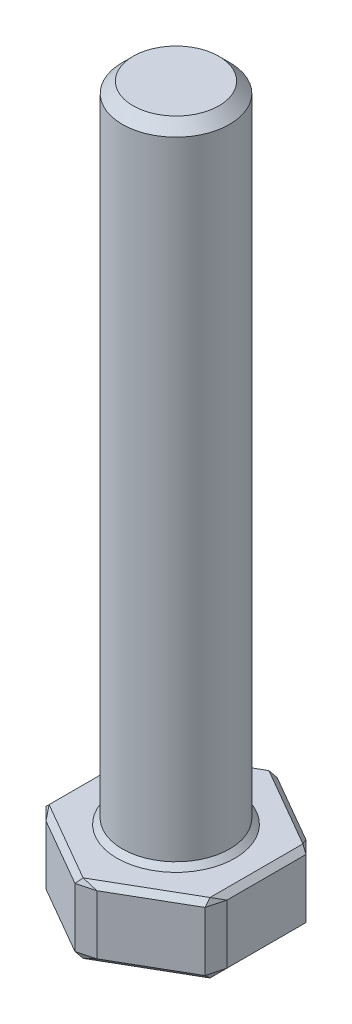
ISO-10303-21;
HEADER;
FILE_DESCRIPTION(('STEP AP214'),'2;1');
FILE_NAME('part.step','',(''),(''),'','','');
FILE_SCHEMA(('AUTOMOTIVE_DESIGN { 1 0 10303 214 1 1 1 1 }'));
ENDSEC;
DATA;
#1=APPLICATION_CONTEXT('core data for automotive mechanical design processes');
#2=APPLICATION_PROTOCOL_DEFINITION('international standard','automotive_design',2000,#1);
#3=PRODUCT_CONTEXT('',#1,'mechanical');
#4=PRODUCT('Part','Part','',(#3));
#5=PRODUCT_RELATED_PRODUCT_CATEGORY('part','',(#4));
#6=PRODUCT_DEFINITION_FORMATION('','',#4);
#7=PRODUCT_DEFINITION_CONTEXT('part definition',#1,'design');
#8=PRODUCT_DEFINITION('design','',#6,#7);
#9=PRODUCT_DEFINITION_SHAPE('','',#8);
#10=(LENGTH_UNIT() NAMED_UNIT(*) SI_UNIT(.MILLI.,.METRE.));
#11=(NAMED_UNIT(*) PLANE_ANGLE_UNIT() SI_UNIT($,.RADIAN.));
#12=(NAMED_UNIT(*) SI_UNIT($,.STERADIAN.) SOLID_ANGLE_UNIT());
#13=UNCERTAINTY_MEASURE_WITH_UNIT(LENGTH_MEASURE(1.E-05),#10,'distance_accuracy_value','');
#14=(GEOMETRIC_REPRESENTATION_CONTEXT(3) GLOBAL_UNCERTAINTY_ASSIGNED_CONTEXT((#13)) GLOBAL_UNIT_ASSIGNED_CONTEXT((#10,
#11,#12)) REPRESENTATION_CONTEXT('',''));
#15=CARTESIAN_POINT('',(0.,0.,0.));
#16=DIRECTION('',(0.,0.,1.));
#17=DIRECTION('',(1.,0.,0.));
#18=AXIS2_PLACEMENT_3D('',#15,#16,#17);
#19=CARTESIAN_POINT('',(-7.99999999999995,6.5,4.6188021535171));
#20=DIRECTION('',(0.499999999999995,0.,-0.866025403784442));
#21=DIRECTION('',(-0.866025403784442,0.,-0.499999999999995));
#22=AXIS2_PLACEMENT_3D('',#19,#20,#21);
#23=PLANE('',#22);
#24=DIRECTION('',(-0.866025403784442,0.,-0.499999999999995));
#25=VECTOR('',#24,1.);
#26=CARTESIAN_POINT('',(-7.99999999999995,6.00000000000001,4.6188021535171));
#27=LINE('',#26,#25);
#28=CARTESIAN_POINT('',(-0.433012701892224,6.00000000000001,8.98760430703402));
#29=VERTEX_POINT('',#28);
#30=CARTESIAN_POINT('',(-6.81698729810772,6.00000000000001,5.30181485540932));
#31=VERTEX_POINT('',#30);
#32=EDGE_CURVE('E254',#29,#31,#27,.T.);
#33=ORIENTED_EDGE('',*,*,#32,.T.);
#34=DIRECTION('',(0.,-1.,0.));
#35=VECTOR('',#34,1.);
#36=CARTESIAN_POINT('',(-6.81698729810772,6.5,5.30181485540932));
#37=LINE('',#36,#35);
#38=CARTESIAN_POINT('',(-6.81698729810772,0.499999999999994,5.30181485540932));
#39=VERTEX_POINT('',#38);
#40=EDGE_CURVE('E256',#31,#39,#37,.T.);
#41=ORIENTED_EDGE('',*,*,#40,.T.);
#42=DIRECTION('',(0.866025403784442,0.,0.499999999999995));
#43=VECTOR('',#42,1.);
#44=CARTESIAN_POINT('',(-7.99999999999995,0.499999999999994,4.6188021535171));
#45=LINE('',#44,#43);
#46=CARTESIAN_POINT('',(-0.433012701892224,0.499999999999994,8.98760430703402));
#47=VERTEX_POINT('',#46);
#48=EDGE_CURVE('E250',#39,#47,#45,.T.);
#49=ORIENTED_EDGE('',*,*,#48,.T.);
#50=DIRECTION('',(0.,1.,0.));
#51=VECTOR('',#50,1.);
#52=CARTESIAN_POINT('',(-0.433012701892223,6.5,8.98760430703402));
#53=LINE('',#52,#51);
#54=EDGE_CURVE('E252',#47,#29,#53,.T.);
#55=ORIENTED_EDGE('',*,*,#54,.T.);
#56=EDGE_LOOP('',(#33,#41,#49,#55));
#57=FACE_BOUND('',#56,.T.);
#58=ADVANCED_FACE('F33',(#57),#23,.F.);
#59=CARTESIAN_POINT('',(0.,6.5,9.23760430703402));
#60=DIRECTION('',(-0.500000000000001,0.,-0.866025403784438));
#61=DIRECTION('',(-0.866025403784438,0.,0.500000000000001));
#62=AXIS2_PLACEMENT_3D('',#59,#60,#61);
#63=PLANE('',#62);
#64=DIRECTION('',(0.866025403784438,0.,-0.500000000000001));
#65=VECTOR('',#64,1.);
#66=CARTESIAN_POINT('',(0.,0.499999999999994,9.23760430703402));
#67=LINE('',#66,#65);
#68=CARTESIAN_POINT('',(1.18301270189224,0.499999999999993,8.55459160514179));
#69=VERTEX_POINT('',#68);
#70=CARTESIAN_POINT('',(7.5669872981078,0.499999999999993,4.86880215351699));
#71=VERTEX_POINT('',#70);
#72=EDGE_CURVE('E241',#69,#71,#67,.T.);
#73=ORIENTED_EDGE('',*,*,#72,.T.);
#74=DIRECTION('',(0.,1.,0.));
#75=VECTOR('',#74,1.);
#76=CARTESIAN_POINT('',(7.5669872981078,6.5,4.86880215351699));
#77=LINE('',#76,#75);
#78=CARTESIAN_POINT('',(7.5669872981078,6.00000000000001,4.86880215351699));
#79=VERTEX_POINT('',#78);
#80=EDGE_CURVE('E247',#71,#79,#77,.T.);
#81=ORIENTED_EDGE('',*,*,#80,.T.);
#82=DIRECTION('',(-0.866025403784438,0.,0.500000000000001));
#83=VECTOR('',#82,1.);
#84=CARTESIAN_POINT('',(0.,6.00000000000001,9.23760430703402));
#85=LINE('',#84,#83);
#86=CARTESIAN_POINT('',(1.18301270189224,6.00000000000001,8.55459160514179));
#87=VERTEX_POINT('',#86);
#88=EDGE_CURVE('E245',#79,#87,#85,.T.);
#89=ORIENTED_EDGE('',*,*,#88,.T.);
#90=DIRECTION('',(0.,-1.,0.));
#91=VECTOR('',#90,1.);
#92=CARTESIAN_POINT('',(1.18301270189224,6.5,8.55459160514179));
#93=LINE('',#92,#91);
#94=EDGE_CURVE('E243',#87,#69,#93,.T.);
#95=ORIENTED_EDGE('',*,*,#94,.T.);
#96=EDGE_LOOP('',(#73,#81,#89,#95));
#97=FACE_BOUND('',#96,.T.);
#98=ADVANCED_FACE('F469',(#97),#63,.F.);
#99=CARTESIAN_POINT('',(8.00000000000002,6.5,4.61880215351699));
#100=DIRECTION('',(-1.,0.,0.));
#101=DIRECTION('',(0.,0.,1.));
#102=AXIS2_PLACEMENT_3D('',#99,#100,#101);
#103=PLANE('',#102);
#104=DIRECTION('',(0.,1.,0.));
#105=VECTOR('',#104,1.);
#106=CARTESIAN_POINT('',(7.99999999999998,6.5,-4.11880215351704));
#107=LINE('',#106,#105);
#108=CARTESIAN_POINT('',(7.99999999999998,0.499999999999994,-4.11880215351704));
#109=VERTEX_POINT('',#108);
#110=CARTESIAN_POINT('',(7.99999999999998,6.00000000000001,-4.11880215351704));
#111=VERTEX_POINT('',#110);
#112=EDGE_CURVE('E236',#109,#111,#107,.T.);
#113=ORIENTED_EDGE('',*,*,#112,.T.);
#114=DIRECTION('',(0.,0.,1.));
#115=VECTOR('',#114,1.);
#116=CARTESIAN_POINT('',(8.00000000000002,6.00000000000001,4.61880215351699));
#117=LINE('',#116,#115);
#118=CARTESIAN_POINT('',(8.00000000000001,6.00000000000001,3.25277674973256));
#119=VERTEX_POINT('',#118);
#120=EDGE_CURVE('E239',#111,#119,#117,.T.);
#121=ORIENTED_EDGE('',*,*,#120,.T.);
#122=DIRECTION('',(0.,-1.,0.));
#123=VECTOR('',#122,1.);
#124=CARTESIAN_POINT('',(8.00000000000001,6.5,3.25277674973256));
#125=LINE('',#124,#123);
#126=CARTESIAN_POINT('',(8.00000000000001,0.499999999999994,3.25277674973256));
#127=VERTEX_POINT('',#126);
#128=EDGE_CURVE('E234',#119,#127,#125,.T.);
#129=ORIENTED_EDGE('',*,*,#128,.T.);
#130=DIRECTION('',(0.,0.,-1.));
#131=VECTOR('',#130,1.);
#132=CARTESIAN_POINT('',(8.00000000000002,0.499999999999994,4.61880215351699));
#133=LINE('',#132,#131);
#134=EDGE_CURVE('E232',#127,#109,#133,.T.);
#135=ORIENTED_EDGE('',*,*,#134,.T.);
#136=EDGE_LOOP('',(#113,#121,#129,#135));
#137=FACE_BOUND('',#136,.T.);
#138=ADVANCED_FACE('F473',(#137),#103,.F.);
#139=CARTESIAN_POINT('',(7.99999999999998,6.5,-4.61880215351705));
#140=DIRECTION('',(-0.499999999999995,0.,0.866025403784441));
#141=DIRECTION('',(0.866025403784441,0.,0.499999999999995));
#142=AXIS2_PLACEMENT_3D('',#139,#140,#141);
#143=PLANE('',#142);
#144=DIRECTION('',(0.,1.,0.));
#145=VECTOR('',#144,1.);
#146=CARTESIAN_POINT('',(0.433012701892162,6.5,-8.98760430703402));
#147=LINE('',#146,#145);
#148=CARTESIAN_POINT('',(0.433012701892161,0.499999999999994,-8.98760430703402));
#149=VERTEX_POINT('',#148);
#150=CARTESIAN_POINT('',(0.433012701892161,6.00000000000001,-8.98760430703402));
#151=VERTEX_POINT('',#150);
#152=EDGE_CURVE('E227',#149,#151,#147,.T.);
#153=ORIENTED_EDGE('',*,*,#152,.T.);
#154=DIRECTION('',(0.866025403784441,0.,0.499999999999995));
#155=VECTOR('',#154,1.);
#156=CARTESIAN_POINT('',(7.99999999999998,6.00000000000001,-4.61880215351705));
#157=LINE('',#156,#155);
#158=CARTESIAN_POINT('',(6.81698729810778,6.00000000000001,-5.30181485540925));
#159=VERTEX_POINT('',#158);
#160=EDGE_CURVE('E230',#151,#159,#157,.T.);
#161=ORIENTED_EDGE('',*,*,#160,.T.);
#162=DIRECTION('',(0.,-1.,0.));
#163=VECTOR('',#162,1.);
#164=CARTESIAN_POINT('',(6.81698729810778,6.5,-5.30181485540925));
#165=LINE('',#164,#163);
#166=CARTESIAN_POINT('',(6.81698729810778,0.499999999999994,-5.30181485540925));
#167=VERTEX_POINT('',#166);
#168=EDGE_CURVE('E225',#159,#167,#165,.T.);
#169=ORIENTED_EDGE('',*,*,#168,.T.);
#170=DIRECTION('',(-0.866025403784441,0.,-0.499999999999995));
#171=VECTOR('',#170,1.);
#172=CARTESIAN_POINT('',(7.99999999999998,0.499999999999994,-4.61880215351705));
#173=LINE('',#172,#171);
#174=EDGE_CURVE('E223',#167,#149,#173,.T.);
#175=ORIENTED_EDGE('',*,*,#174,.T.);
#176=EDGE_LOOP('',(#153,#161,#169,#175));
#177=FACE_BOUND('',#176,.T.);
#178=ADVANCED_FACE('F430',(#177),#143,.F.);
#179=CARTESIAN_POINT('',(0.,6.5,-9.23760430703402));
#180=DIRECTION('',(0.500000000000007,0.,0.866025403784434));
#181=DIRECTION('',(0.866025403784435,0.,-0.500000000000007));
#182=AXIS2_PLACEMENT_3D('',#179,#180,#181);
#183=PLANE('',#182);
#184=DIRECTION('',(0.,1.,0.));
#185=VECTOR('',#184,1.);
#186=CARTESIAN_POINT('',(-7.56698729810783,6.5,-4.86880215351694));
#187=LINE('',#186,#185);
#188=CARTESIAN_POINT('',(-7.56698729810783,0.499999999999994,-4.86880215351694));
#189=VERTEX_POINT('',#188);
#190=CARTESIAN_POINT('',(-7.56698729810783,6.00000000000001,-4.86880215351694));
#191=VERTEX_POINT('',#190);
#192=EDGE_CURVE('E218',#189,#191,#187,.T.);
#193=ORIENTED_EDGE('',*,*,#192,.T.);
#194=DIRECTION('',(0.866025403784435,0.,-0.500000000000007));
#195=VECTOR('',#194,1.);
#196=CARTESIAN_POINT('',(0.,6.00000000000001,-9.23760430703402));
#197=LINE('',#196,#195);
#198=CARTESIAN_POINT('',(-1.18301270189227,6.00000000000001,-8.55459160514179));
#199=VERTEX_POINT('',#198);
#200=EDGE_CURVE('E221',#191,#199,#197,.T.);
#201=ORIENTED_EDGE('',*,*,#200,.T.);
#202=DIRECTION('',(0.,-1.,0.));
#203=VECTOR('',#202,1.);
#204=CARTESIAN_POINT('',(-1.18301270189227,6.5,-8.55459160514179));
#205=LINE('',#204,#203);
#206=CARTESIAN_POINT('',(-1.18301270189227,0.499999999999994,-8.55459160514179));
#207=VERTEX_POINT('',#206);
#208=EDGE_CURVE('E216',#199,#207,#205,.T.);
#209=ORIENTED_EDGE('',*,*,#208,.T.);
#210=DIRECTION('',(-0.866025403784435,0.,0.500000000000007));
#211=VECTOR('',#210,1.);
#212=CARTESIAN_POINT('',(0.,0.499999999999994,-9.23760430703402));
#213=LINE('',#212,#211);
#214=EDGE_CURVE('E214',#207,#189,#213,.T.);
#215=ORIENTED_EDGE('',*,*,#214,.T.);
#216=EDGE_LOOP('',(#193,#201,#209,#215));
#217=FACE_BOUND('',#216,.T.);
#218=ADVANCED_FACE('F447',(#217),#183,.F.);
#219=CARTESIAN_POINT('',(-8.00000000000005,6.5,-4.61880215351694));
#220=DIRECTION('',(1.,0.,0.));
#221=DIRECTION('',(0.,0.,-1.));
#222=AXIS2_PLACEMENT_3D('',#219,#220,#221);
#223=PLANE('',#222);
#224=DIRECTION('',(0.,1.,0.));
#225=VECTOR('',#224,1.);
#226=CARTESIAN_POINT('',(-7.99999999999996,6.5,4.1188021535171));
#227=LINE('',#226,#225);
#228=CARTESIAN_POINT('',(-7.99999999999996,0.499999999999994,4.1188021535171));
#229=VERTEX_POINT('',#228);
#230=CARTESIAN_POINT('',(-7.99999999999996,6.00000000000001,4.1188021535171));
#231=VERTEX_POINT('',#230);
#232=EDGE_CURVE('E208',#229,#231,#227,.T.);
#233=ORIENTED_EDGE('',*,*,#232,.T.);
#234=DIRECTION('',(0.,0.,-1.));
#235=VECTOR('',#234,1.);
#236=CARTESIAN_POINT('',(-8.00000000000005,6.00000000000001,-4.61880215351694));
#237=LINE('',#236,#235);
#238=CARTESIAN_POINT('',(-8.00000000000004,6.00000000000001,-3.25277674973253));
#239=VERTEX_POINT('',#238);
#240=EDGE_CURVE('E169',#231,#239,#237,.T.);
#241=ORIENTED_EDGE('',*,*,#240,.T.);
#242=DIRECTION('',(0.,-1.,0.));
#243=VECTOR('',#242,1.);
#244=CARTESIAN_POINT('',(-8.00000000000004,6.5,-3.25277674973253));
#245=LINE('',#244,#243);
#246=CARTESIAN_POINT('',(-8.00000000000004,0.499999999999994,-3.25277674973253));
#247=VERTEX_POINT('',#246);
#248=EDGE_CURVE('E210',#239,#247,#245,.T.);
#249=ORIENTED_EDGE('',*,*,#248,.T.);
#250=DIRECTION('',(0.,0.,1.));
#251=VECTOR('',#250,1.);
#252=CARTESIAN_POINT('',(-8.00000000000005,0.499999999999994,-4.61880215351694));
#253=LINE('',#252,#251);
#254=EDGE_CURVE('E201',#247,#229,#253,.T.);
#255=ORIENTED_EDGE('',*,*,#254,.T.);
#256=EDGE_LOOP('',(#233,#241,#249,#255));
#257=FACE_BOUND('',#256,.T.);
#258=ADVANCED_FACE('F394',(#257),#223,.F.);
#259=CARTESIAN_POINT('',(0.,6.5,0.));
#260=DIRECTION('',(0.,1.,0.));
#261=DIRECTION('',(0.,0.,1.));
#262=AXIS2_PLACEMENT_3D('',#259,#260,#261);
#263=PLANE('',#262);
#264=CARTESIAN_POINT('',(0.,6.5,0.));
#265=DIRECTION('',(0.,1.,0.));
#266=DIRECTION('',(0.,0.,1.));
#267=AXIS2_PLACEMENT_3D('',#264,#265,#266);
#268=CIRCLE('',#267,5.49999999999998);
#269=CARTESIAN_POINT('',(0.,6.5,5.49999999999998));
#270=VERTEX_POINT('',#269);
#271=EDGE_CURVE('E198',#270,#270,#268,.F.);
#272=ORIENTED_EDGE('',*,*,#271,.T.);
#273=EDGE_LOOP('',(#272));
#274=FACE_BOUND('',#273,.T.);
#275=DIRECTION('',(-0.866025403784435,0.,0.500000000000007));
#276=VECTOR('',#275,1.);
#277=CARTESIAN_POINT('',(-7.75000000000004,6.5,-4.18578945162472));
#278=LINE('',#277,#276);
#279=CARTESIAN_POINT('',(0.,6.5,-8.66025403784439));
#280=VERTEX_POINT('',#279);
#281=CARTESIAN_POINT('',(-7.50000000000004,6.5,-4.33012701892212));
#282=VERTEX_POINT('',#281);
#283=EDGE_CURVE('E197',#280,#282,#278,.T.);
#284=ORIENTED_EDGE('',*,*,#283,.T.);
#285=DIRECTION('',(0.,0.,1.));
#286=VECTOR('',#285,1.);
#287=CARTESIAN_POINT('',(-7.49999999999995,6.5,4.6188021535171));
#288=LINE('',#287,#286);
#289=CARTESIAN_POINT('',(-7.49999999999995,6.5,4.33012701892229));
#290=VERTEX_POINT('',#289);
#291=EDGE_CURVE('E167',#282,#290,#288,.T.);
#292=ORIENTED_EDGE('',*,*,#291,.T.);
#293=DIRECTION('',(0.866025403784442,0.,0.499999999999995));
#294=VECTOR('',#293,1.);
#295=CARTESIAN_POINT('',(0.249999999999998,6.5,8.8045916051418));
#296=LINE('',#295,#294);
#297=CARTESIAN_POINT('',(0.,6.5,8.66025403784439));
#298=VERTEX_POINT('',#297);
#299=EDGE_CURVE('E186',#290,#298,#296,.T.);
#300=ORIENTED_EDGE('',*,*,#299,.T.);
#301=DIRECTION('',(0.866025403784438,0.,-0.500000000000001));
#302=VECTOR('',#301,1.);
#303=CARTESIAN_POINT('',(7.75000000000002,6.5,4.18578945162477));
#304=LINE('',#303,#302);
#305=CARTESIAN_POINT('',(7.50000000000002,6.5,4.33012701892218));
#306=VERTEX_POINT('',#305);
#307=EDGE_CURVE('E192',#298,#306,#304,.T.);
#308=ORIENTED_EDGE('',*,*,#307,.T.);
#309=DIRECTION('',(0.,0.,-1.));
#310=VECTOR('',#309,1.);
#311=CARTESIAN_POINT('',(7.49999999999998,6.5,-4.61880215351704));
#312=LINE('',#311,#310);
#313=CARTESIAN_POINT('',(7.49999999999998,6.5,-4.33012701892223));
#314=VERTEX_POINT('',#313);
#315=EDGE_CURVE('E371',#306,#314,#312,.T.);
#316=ORIENTED_EDGE('',*,*,#315,.T.);
#317=DIRECTION('',(-0.866025403784441,0.,-0.499999999999995));
#318=VECTOR('',#317,1.);
#319=CARTESIAN_POINT('',(-0.250000000000063,6.5,-8.8045916051418));
#320=LINE('',#319,#318);
#321=EDGE_CURVE('E203',#314,#280,#320,.T.);
#322=ORIENTED_EDGE('',*,*,#321,.T.);
#323=EDGE_LOOP('',(#284,#292,#300,#308,#316,#322));
#324=FACE_BOUND('',#323,.T.);
#325=ADVANCED_FACE('F195',(#274,#324),#263,.T.);
#326=CARTESIAN_POINT('',(0.,0.,0.));
#327=DIRECTION('',(0.,1.,0.));
#328=DIRECTION('',(0.,0.,1.));
#329=AXIS2_PLACEMENT_3D('',#326,#327,#328);
#330=PLANE('',#329);
#331=DIRECTION('',(-0.866025403784442,0.,-0.499999999999995));
#332=VECTOR('',#331,1.);
#333=CARTESIAN_POINT('',(-3.74999999999998,0.,6.49519052838335));
#334=LINE('',#333,#332);
#335=CARTESIAN_POINT('',(0.,0.,8.66025403784441));
#336=VERTEX_POINT('',#335);
#337=CARTESIAN_POINT('',(-7.49999999999996,0.,4.33012701892229));
#338=VERTEX_POINT('',#337);
#339=EDGE_CURVE('E259',#336,#338,#334,.T.);
#340=ORIENTED_EDGE('',*,*,#339,.T.);
#341=DIRECTION('',(0.,0.,-1.));
#342=VECTOR('',#341,1.);
#343=CARTESIAN_POINT('',(-7.50000000000001,0.,0.));
#344=LINE('',#343,#342);
#345=CARTESIAN_POINT('',(-7.50000000000006,0.,-4.33012701892213));
#346=VERTEX_POINT('',#345);
#347=EDGE_CURVE('E11',#338,#346,#344,.T.);
#348=ORIENTED_EDGE('',*,*,#347,.T.);
#349=DIRECTION('',(0.866025403784435,0.,-0.500000000000007));
#350=VECTOR('',#349,1.);
#351=CARTESIAN_POINT('',(-3.75000000000006,0.,-6.49519052838327));
#352=LINE('',#351,#350);
#353=CARTESIAN_POINT('',(0.,0.,-8.6602540378444));
#354=VERTEX_POINT('',#353);
#355=EDGE_CURVE('E42',#346,#354,#352,.T.);
#356=ORIENTED_EDGE('',*,*,#355,.T.);
#357=DIRECTION('',(0.866025403784441,0.,0.499999999999995));
#358=VECTOR('',#357,1.);
#359=CARTESIAN_POINT('',(3.74999999999997,0.,-6.49519052838332));
#360=LINE('',#359,#358);
#361=CARTESIAN_POINT('',(7.49999999999999,0.,-4.33012701892224));
#362=VERTEX_POINT('',#361);
#363=EDGE_CURVE('E265',#354,#362,#360,.T.);
#364=ORIENTED_EDGE('',*,*,#363,.T.);
#365=DIRECTION('',(0.,0.,1.));
#366=VECTOR('',#365,1.);
#367=CARTESIAN_POINT('',(7.50000000000001,0.,0.));
#368=LINE('',#367,#366);
#369=CARTESIAN_POINT('',(7.50000000000003,0.,4.33012701892218));
#370=VERTEX_POINT('',#369);
#371=EDGE_CURVE('E263',#362,#370,#368,.T.);
#372=ORIENTED_EDGE('',*,*,#371,.T.);
#373=DIRECTION('',(-0.866025403784438,0.,0.500000000000001));
#374=VECTOR('',#373,1.);
#375=CARTESIAN_POINT('',(3.75000000000001,0.,6.49519052838329));
#376=LINE('',#375,#374);
#377=EDGE_CURVE('E261',#370,#336,#376,.T.);
#378=ORIENTED_EDGE('',*,*,#377,.T.);
#379=EDGE_LOOP('',(#340,#348,#356,#364,#372,#378));
#380=FACE_BOUND('',#379,.T.);
#381=ADVANCED_FACE('F747',(#380),#330,.F.);
#382=CARTESIAN_POINT('',(0.,66.5,0.));
#383=DIRECTION('',(0.,-1.,0.));
#384=DIRECTION('',(0.,0.,-1.));
#385=AXIS2_PLACEMENT_3D('',#382,#383,#384);
#386=CYLINDRICAL_SURFACE('',#385,5.);
#387=CARTESIAN_POINT('',(0.,6.99999999999999,0.));
#388=DIRECTION('',(0.,1.,0.));
#389=DIRECTION('',(0.,0.,1.));
#390=AXIS2_PLACEMENT_3D('',#387,#388,#389);
#391=CIRCLE('',#390,5.);
#392=CARTESIAN_POINT('',(0.,6.99999999999999,5.));
#393=VERTEX_POINT('',#392);
#394=EDGE_CURVE('E193',#393,#393,#391,.T.);
#395=ORIENTED_EDGE('',*,*,#394,.T.);
#396=EDGE_LOOP('',(#395));
#397=FACE_BOUND('',#396,.T.);
#398=CARTESIAN_POINT('',(0.,65.5,0.));
#399=DIRECTION('',(0.,1.,0.));
#400=DIRECTION('',(0.,0.,1.));
#401=AXIS2_PLACEMENT_3D('',#398,#399,#400);
#402=CIRCLE('',#401,5.);
#403=CARTESIAN_POINT('',(0.,65.5,5.));
#404=VERTEX_POINT('',#403);
#405=EDGE_CURVE('E361',#404,#404,#402,.F.);
#406=ORIENTED_EDGE('',*,*,#405,.T.);
#407=EDGE_LOOP('',(#406));
#408=FACE_BOUND('',#407,.T.);
#409=ADVANCED_FACE('F740',(#397,#408),#386,.T.);
#410=CARTESIAN_POINT('',(0.,66.5,0.));
#411=DIRECTION('',(0.,1.,0.));
#412=DIRECTION('',(0.,0.,1.));
#413=AXIS2_PLACEMENT_3D('',#410,#411,#412);
#414=PLANE('',#413);
#415=CARTESIAN_POINT('',(0.,66.5,0.));
#416=DIRECTION('',(0.,1.,0.));
#417=DIRECTION('',(0.,0.,1.));
#418=AXIS2_PLACEMENT_3D('',#415,#416,#417);
#419=CIRCLE('',#418,4.);
#420=CARTESIAN_POINT('',(0.,66.5,4.));
#421=VERTEX_POINT('',#420);
#422=EDGE_CURVE('E355',#421,#421,#419,.T.);
#423=ORIENTED_EDGE('',*,*,#422,.T.);
#424=EDGE_LOOP('',(#423));
#425=FACE_BOUND('',#424,.T.);
#426=ADVANCED_FACE('F500',(#425),#414,.T.);
#427=CARTESIAN_POINT('',(0.,66.5,0.));
#428=DIRECTION('',(0.,-1.,0.));
#429=DIRECTION('',(0.,0.,-1.));
#430=AXIS2_PLACEMENT_3D('',#427,#428,#429);
#431=CONICAL_SURFACE('',#430,4.,0.785398163397439);
#432=ORIENTED_EDGE('',*,*,#405,.F.);
#433=EDGE_LOOP('',(#432));
#434=FACE_BOUND('',#433,.T.);
#435=ORIENTED_EDGE('',*,*,#422,.F.);
#436=EDGE_LOOP('',(#435));
#437=FACE_BOUND('',#436,.T.);
#438=ADVANCED_FACE('F496',(#434,#437),#431,.T.);
#439=CARTESIAN_POINT('',(0.,6.99999999999999,0.));
#440=DIRECTION('',(0.,-1.,0.));
#441=DIRECTION('',(0.,0.,-1.));
#442=AXIS2_PLACEMENT_3D('',#439,#440,#441);
#443=CONICAL_SURFACE('',#442,5.,0.785398163397446);
#444=ORIENTED_EDGE('',*,*,#271,.F.);
#445=EDGE_LOOP('',(#444));
#446=FACE_BOUND('',#445,.T.);
#447=ORIENTED_EDGE('',*,*,#394,.F.);
#448=EDGE_LOOP('',(#447));
#449=FACE_BOUND('',#448,.T.);
#450=ADVANCED_FACE('F499',(#446,#449),#443,.T.);
#451=CARTESIAN_POINT('',(8.00000000000001,6.5,3.25277674973256));
#452=DIRECTION('',(-0.965925826289069,0.,-0.258819045102519));
#453=DIRECTION('',(0.,-1.,0.));
#454=AXIS2_PLACEMENT_3D('',#451,#452,#453);
#455=PLANE('',#454);
#456=DIRECTION('',(-0.258819045102519,0.,0.965925826289069));
#457=VECTOR('',#456,1.);
#458=CARTESIAN_POINT('',(7.5669872981078,6.00000000000001,4.86880215351699));
#459=LINE('',#458,#457);
#460=EDGE_CURVE('E37',#79,#119,#459,.F.);
#461=ORIENTED_EDGE('',*,*,#460,.F.);
#462=ORIENTED_EDGE('',*,*,#80,.F.);
#463=DIRECTION('',(0.258819045102519,0.,-0.965925826289069));
#464=VECTOR('',#463,1.);
#465=CARTESIAN_POINT('',(8.00000000000001,0.499999999999994,3.25277674973256));
#466=LINE('',#465,#464);
#467=EDGE_CURVE('E348',#127,#71,#466,.F.);
#468=ORIENTED_EDGE('',*,*,#467,.F.);
#469=ORIENTED_EDGE('',*,*,#128,.F.);
#470=EDGE_LOOP('',(#461,#462,#468,#469));
#471=FACE_BOUND('',#470,.T.);
#472=ADVANCED_FACE('F35',(#471),#455,.F.);
#473=CARTESIAN_POINT('',(7.5669872981078,6.00000000000001,4.86880215351699));
#474=DIRECTION('',(0.894273544867828,0.377964473009232,0.23961987415985));
#475=DIRECTION('',(-0.389306214312523,0.921108392914565,0.));
#476=AXIS2_PLACEMENT_3D('',#473,#474,#475);
#477=PLANE('',#476);
#478=DIRECTION('',(0.0907675134870627,-0.677497944020804,0.729902592366241));
#479=VECTOR('',#478,1.);
#480=CARTESIAN_POINT('',(7.5669872981078,6.00000000000001,4.86880215351699));
#481=LINE('',#480,#479);
#482=EDGE_CURVE('E343',#79,#306,#481,.F.);
#483=ORIENTED_EDGE('',*,*,#482,.F.);
#484=ORIENTED_EDGE('',*,*,#460,.T.);
#485=DIRECTION('',(-0.387995381130103,0.3879953811301,0.836013856609694));
#486=VECTOR('',#485,1.);
#487=CARTESIAN_POINT('',(7.41062471148732,6.5893752885127,4.52270400119829));
#488=LINE('',#487,#486);
#489=EDGE_CURVE('E346',#306,#119,#488,.F.);
#490=ORIENTED_EDGE('',*,*,#489,.F.);
#491=EDGE_LOOP('',(#483,#484,#490));
#492=FACE_BOUND('',#491,.T.);
#493=ADVANCED_FACE('F414',(#492),#477,.T.);
#494=CARTESIAN_POINT('',(8.00000000000001,0.499999999999994,3.25277674973256));
#495=DIRECTION('',(0.894273544867835,-0.377964473009215,0.239619874159852));
#496=DIRECTION('',(0.389306214312506,0.921108392914572,0.));
#497=AXIS2_PLACEMENT_3D('',#494,#495,#496);
#498=PLANE('',#497);
#499=DIRECTION('',(-0.387995381130095,-0.3879953811301,0.836013856609698));
#500=VECTOR('',#499,1.);
#501=CARTESIAN_POINT('',(8.00000000000001,0.499999999999993,3.25277674973256));
#502=LINE('',#501,#500);
#503=EDGE_CURVE('E337',#127,#370,#502,.T.);
#504=ORIENTED_EDGE('',*,*,#503,.F.);
#505=ORIENTED_EDGE('',*,*,#467,.T.);
#506=DIRECTION('',(0.0907675134870508,0.677497944020809,0.729902592366238));
#507=VECTOR('',#506,1.);
#508=CARTESIAN_POINT('',(7.46349076226023,-0.272508660381066,4.03653974030414));
#509=LINE('',#508,#507);
#510=EDGE_CURVE('E340',#370,#71,#509,.T.);
#511=ORIENTED_EDGE('',*,*,#510,.F.);
#512=EDGE_LOOP('',(#504,#505,#511));
#513=FACE_BOUND('',#512,.T.);
#514=ADVANCED_FACE('F702',(#513),#498,.T.);
#515=CARTESIAN_POINT('',(7.5,6.5,0.));
#516=DIRECTION('',(0.707106781186543,0.707106781186552,0.));
#517=DIRECTION('',(0.,0.,1.));
#518=AXIS2_PLACEMENT_3D('',#515,#516,#517);
#519=PLANE('',#518);
#520=ORIENTED_EDGE('',*,*,#489,.T.);
#521=ORIENTED_EDGE('',*,*,#120,.F.);
#522=DIRECTION('',(0.677497944020814,-0.677497944020803,0.28634432366498));
#523=VECTOR('',#522,1.);
#524=CARTESIAN_POINT('',(7.99999999999998,6.00000000000001,-4.11880215351704));
#525=LINE('',#524,#523);
#526=EDGE_CURVE('E332',#314,#111,#525,.T.);
#527=ORIENTED_EDGE('',*,*,#526,.F.);
#528=ORIENTED_EDGE('',*,*,#315,.F.);
#529=EDGE_LOOP('',(#520,#521,#527,#528));
#530=FACE_BOUND('',#529,.T.);
#531=ADVANCED_FACE('F417',(#530),#519,.T.);
#532=CARTESIAN_POINT('',(3.75000000000001,6.5,6.49519052838329));
#533=DIRECTION('',(0.353553390593272,0.707106781186552,0.61237243569579));
#534=DIRECTION('',(-0.866025403784438,0.,0.500000000000001));
#535=AXIS2_PLACEMENT_3D('',#532,#533,#534);
#536=PLANE('',#535);
#537=ORIENTED_EDGE('',*,*,#482,.T.);
#538=ORIENTED_EDGE('',*,*,#307,.F.);
#539=DIRECTION('',(-0.91800692830485,0.387995381130093,0.08199307169516));
#540=VECTOR('',#539,1.);
#541=CARTESIAN_POINT('',(1.18301270189224,6.00000000000001,8.55459160514179));
#542=LINE('',#541,#540);
#543=EDGE_CURVE('E329',#87,#298,#542,.T.);
#544=ORIENTED_EDGE('',*,*,#543,.F.);
#545=ORIENTED_EDGE('',*,*,#88,.F.);
#546=EDGE_LOOP('',(#537,#538,#544,#545));
#547=FACE_BOUND('',#546,.T.);
#548=ADVANCED_FACE('F413',(#547),#536,.T.);
#549=CARTESIAN_POINT('',(1.18301270189223,6.5,8.55459160514179));
#550=DIRECTION('',(-0.258819045102524,0.,-0.965925826289068));
#551=DIRECTION('',(0.,-1.,0.));
#552=AXIS2_PLACEMENT_3D('',#549,#550,#551);
#553=PLANE('',#552);
#554=DIRECTION('',(0.965925826289068,0.,-0.258819045102524));
#555=VECTOR('',#554,1.);
#556=CARTESIAN_POINT('',(1.18301270189224,0.499999999999993,8.55459160514179));
#557=LINE('',#556,#555);
#558=EDGE_CURVE('E323',#69,#47,#557,.F.);
#559=ORIENTED_EDGE('',*,*,#558,.F.);
#560=ORIENTED_EDGE('',*,*,#94,.F.);
#561=DIRECTION('',(-0.965925826289067,0.,0.258819045102524));
#562=VECTOR('',#561,1.);
#563=CARTESIAN_POINT('',(1.18301270189224,6.00000000000001,8.55459160514179));
#564=LINE('',#563,#562);
#565=EDGE_CURVE('E326',#29,#87,#564,.F.);
#566=ORIENTED_EDGE('',*,*,#565,.F.);
#567=ORIENTED_EDGE('',*,*,#54,.F.);
#568=EDGE_LOOP('',(#559,#560,#566,#567));
#569=FACE_BOUND('',#568,.T.);
#570=ADVANCED_FACE('F408',(#569),#553,.F.);
#571=CARTESIAN_POINT('',(0.,0.499999999999994,9.23760430703402));
#572=DIRECTION('',(-0.353553390593276,0.707106781186546,-0.612372435695796));
#573=DIRECTION('',(0.866025403784438,0.,-0.500000000000001));
#574=AXIS2_PLACEMENT_3D('',#571,#572,#573);
#575=PLANE('',#574);
#576=ORIENTED_EDGE('',*,*,#510,.T.);
#577=ORIENTED_EDGE('',*,*,#72,.F.);
#578=DIRECTION('',(-0.91800692830485,-0.387995381130093,0.0819930716951692));
#579=VECTOR('',#578,1.);
#580=CARTESIAN_POINT('',(1.18301270189224,0.499999999999994,8.55459160514179));
#581=LINE('',#580,#579);
#582=EDGE_CURVE('E320',#336,#69,#581,.F.);
#583=ORIENTED_EDGE('',*,*,#582,.F.);
#584=ORIENTED_EDGE('',*,*,#377,.F.);
#585=EDGE_LOOP('',(#576,#577,#583,#584));
#586=FACE_BOUND('',#585,.T.);
#587=ADVANCED_FACE('F466',(#586),#575,.F.);
#588=CARTESIAN_POINT('',(8.00000000000002,0.499999999999994,4.61880215351699));
#589=DIRECTION('',(-0.707106781186549,0.707106781186546,0.));
#590=DIRECTION('',(0.,0.,-1.));
#591=AXIS2_PLACEMENT_3D('',#588,#589,#590);
#592=PLANE('',#591);
#593=ORIENTED_EDGE('',*,*,#503,.T.);
#594=ORIENTED_EDGE('',*,*,#371,.F.);
#595=DIRECTION('',(0.677497944020805,0.677497944020807,0.286344323664992));
#596=VECTOR('',#595,1.);
#597=CARTESIAN_POINT('',(7.22749133961893,-0.272508660381064,-4.44530273087579));
#598=LINE('',#597,#596);
#599=EDGE_CURVE('E317',#109,#362,#598,.F.);
#600=ORIENTED_EDGE('',*,*,#599,.F.);
#601=ORIENTED_EDGE('',*,*,#134,.F.);
#602=EDGE_LOOP('',(#593,#594,#600,#601));
#603=FACE_BOUND('',#602,.T.);
#604=ADVANCED_FACE('F476',(#603),#592,.F.);
#605=CARTESIAN_POINT('',(6.81698729810778,6.5,-5.30181485540925));
#606=DIRECTION('',(-0.707106781186548,0.,0.707106781186547));
#607=DIRECTION('',(0.,-1.,0.));
#608=AXIS2_PLACEMENT_3D('',#605,#606,#607);
#609=PLANE('',#608);
#610=DIRECTION('',(0.707106781186547,0.,0.707106781186548));
#611=VECTOR('',#610,1.);
#612=CARTESIAN_POINT('',(7.99999999999998,6.00000000000001,-4.11880215351704));
#613=LINE('',#612,#611);
#614=EDGE_CURVE('E334',#111,#159,#613,.F.);
#615=ORIENTED_EDGE('',*,*,#614,.F.);
#616=ORIENTED_EDGE('',*,*,#112,.F.);
#617=DIRECTION('',(-0.707106781186547,0.,-0.707106781186548));
#618=VECTOR('',#617,1.);
#619=CARTESIAN_POINT('',(6.81698729810778,0.499999999999994,-5.30181485540925));
#620=LINE('',#619,#618);
#621=EDGE_CURVE('E314',#167,#109,#620,.F.);
#622=ORIENTED_EDGE('',*,*,#621,.F.);
#623=ORIENTED_EDGE('',*,*,#168,.F.);
#624=EDGE_LOOP('',(#615,#616,#622,#623));
#625=FACE_BOUND('',#624,.T.);
#626=ADVANCED_FACE('F425',(#625),#609,.F.);
#627=CARTESIAN_POINT('',(7.99999999999998,6.00000000000001,-4.11880215351704));
#628=DIRECTION('',(0.654653670707976,0.377964473009232,-0.654653670707976));
#629=DIRECTION('',(-0.707106781186547,0.,-0.707106781186548));
#630=AXIS2_PLACEMENT_3D('',#627,#628,#629);
#631=PLANE('',#630);
#632=ORIENTED_EDGE('',*,*,#526,.T.);
#633=ORIENTED_EDGE('',*,*,#614,.T.);
#634=DIRECTION('',(0.530011547174742,0.387995381130104,0.754020784914542));
#635=VECTOR('',#634,1.);
#636=CARTESIAN_POINT('',(7.62208891457889,6.5893752885127,-4.15643725746161));
#637=LINE('',#636,#635);
#638=EDGE_CURVE('E311',#314,#159,#637,.F.);
#639=ORIENTED_EDGE('',*,*,#638,.F.);
#640=EDGE_LOOP('',(#632,#633,#639));
#641=FACE_BOUND('',#640,.T.);
#642=ADVANCED_FACE('F421',(#641),#631,.T.);
#643=CARTESIAN_POINT('',(1.18301270189224,6.00000000000001,8.55459160514179));
#644=DIRECTION('',(0.239619874159855,0.377964473009228,0.894273544867828));
#645=DIRECTION('',(0.,-0.921108392914566,0.38930621431252));
#646=AXIS2_PLACEMENT_3D('',#643,#644,#645);
#647=PLANE('',#646);
#648=ORIENTED_EDGE('',*,*,#565,.T.);
#649=ORIENTED_EDGE('',*,*,#543,.T.);
#650=DIRECTION('',(-0.586730430533753,-0.677497944020804,0.443558268701262));
#651=VECTOR('',#650,1.);
#652=CARTESIAN_POINT('',(0.235999422641279,6.77250866038108,8.48184247117989));
#653=LINE('',#652,#651);
#654=EDGE_CURVE('E189',#29,#298,#653,.F.);
#655=ORIENTED_EDGE('',*,*,#654,.F.);
#656=EDGE_LOOP('',(#648,#649,#655));
#657=FACE_BOUND('',#656,.T.);
#658=ADVANCED_FACE('F411',(#657),#647,.T.);
#659=CARTESIAN_POINT('',(1.18301270189224,0.499999999999993,8.55459160514179));
#660=DIRECTION('',(0.239619874159857,-0.37796447300921,0.894273544867835));
#661=DIRECTION('',(0.,-0.921108392914574,-0.389306214312501));
#662=AXIS2_PLACEMENT_3D('',#659,#660,#661);
#663=PLANE('',#662);
#664=ORIENTED_EDGE('',*,*,#582,.T.);
#665=ORIENTED_EDGE('',*,*,#558,.T.);
#666=DIRECTION('',(-0.586730430533757,0.677497944020808,0.443558268701249));
#667=VECTOR('',#666,1.);
#668=CARTESIAN_POINT('',(0.235999422641284,-0.272508660381083,8.48184247117991));
#669=LINE('',#668,#667);
#670=EDGE_CURVE('E307',#336,#47,#669,.T.);
#671=ORIENTED_EDGE('',*,*,#670,.F.);
#672=EDGE_LOOP('',(#664,#665,#671));
#673=FACE_BOUND('',#672,.T.);
#674=ADVANCED_FACE('F461',(#673),#663,.T.);
#675=CARTESIAN_POINT('',(6.81698729810778,0.499999999999994,-5.30181485540925));
#676=DIRECTION('',(0.654653670707982,-0.377964473009213,-0.654653670707981));
#677=DIRECTION('',(-0.707106781186547,0.,-0.707106781186548));
#678=AXIS2_PLACEMENT_3D('',#675,#676,#677);
#679=PLANE('',#678);
#680=ORIENTED_EDGE('',*,*,#621,.T.);
#681=ORIENTED_EDGE('',*,*,#599,.T.);
#682=DIRECTION('',(0.53001154717475,-0.387995381130103,0.754020784914537));
#683=VECTOR('',#682,1.);
#684=CARTESIAN_POINT('',(6.81698729810778,0.499999999999994,-5.30181485540925));
#685=LINE('',#684,#683);
#686=EDGE_CURVE('E304',#167,#362,#685,.T.);
#687=ORIENTED_EDGE('',*,*,#686,.F.);
#688=EDGE_LOOP('',(#680,#681,#687));
#689=FACE_BOUND('',#688,.T.);
#690=ADVANCED_FACE('F479',(#689),#679,.T.);
#691=CARTESIAN_POINT('',(3.74999999999996,6.5,-6.49519052838331));
#692=DIRECTION('',(0.353553390593267,0.707106781186553,-0.612372435695792));
#693=DIRECTION('',(0.866025403784441,0.,0.499999999999995));
#694=AXIS2_PLACEMENT_3D('',#691,#692,#693);
#695=PLANE('',#694);
#696=ORIENTED_EDGE('',*,*,#638,.T.);
#697=ORIENTED_EDGE('',*,*,#160,.F.);
#698=DIRECTION('',(0.586730430533753,-0.677497944020803,-0.443558268701264));
#699=VECTOR('',#698,1.);
#700=CARTESIAN_POINT('',(0.43301270189216,6.00000000000001,-8.98760430703402));
#701=LINE('',#700,#699);
#702=EDGE_CURVE('E183',#280,#151,#701,.T.);
#703=ORIENTED_EDGE('',*,*,#702,.F.);
#704=ORIENTED_EDGE('',*,*,#321,.F.);
#705=EDGE_LOOP('',(#696,#697,#703,#704));
#706=FACE_BOUND('',#705,.T.);
#707=ADVANCED_FACE('F379',(#706),#695,.T.);
#708=CARTESIAN_POINT('',(-3.74999999999998,6.5,6.49519052838334));
#709=DIRECTION('',(-0.353553390593268,0.707106781186552,0.612372435695793));
#710=DIRECTION('',(-0.866025403784442,0.,-0.499999999999995));
#711=AXIS2_PLACEMENT_3D('',#708,#709,#710);
#712=PLANE('',#711);
#713=ORIENTED_EDGE('',*,*,#654,.T.);
#714=ORIENTED_EDGE('',*,*,#299,.F.);
#715=DIRECTION('',(-0.530011547174752,0.387995381130097,-0.754020784914538));
#716=VECTOR('',#715,1.);
#717=CARTESIAN_POINT('',(-7.62208891457887,6.5893752885127,4.15643725746166));
#718=LINE('',#717,#716);
#719=EDGE_CURVE('E176',#31,#290,#718,.T.);
#720=ORIENTED_EDGE('',*,*,#719,.F.);
#721=ORIENTED_EDGE('',*,*,#32,.F.);
#722=EDGE_LOOP('',(#713,#714,#720,#721));
#723=FACE_BOUND('',#722,.T.);
#724=ADVANCED_FACE('F187',(#723),#712,.T.);
#725=CARTESIAN_POINT('',(-6.81698729810772,6.5,5.30181485540932));
#726=DIRECTION('',(0.707106781186544,0.,-0.707106781186551));
#727=DIRECTION('',(0.,-1.,0.));
#728=AXIS2_PLACEMENT_3D('',#725,#726,#727);
#729=PLANE('',#728);
#730=DIRECTION('',(0.707106781186551,0.,0.707106781186544));
#731=VECTOR('',#730,1.);
#732=CARTESIAN_POINT('',(-6.81698729810772,0.499999999999994,5.30181485540932));
#733=LINE('',#732,#731);
#734=EDGE_CURVE('E296',#39,#229,#733,.F.);
#735=ORIENTED_EDGE('',*,*,#734,.F.);
#736=ORIENTED_EDGE('',*,*,#40,.F.);
#737=DIRECTION('',(-0.707106781186551,0.,-0.707106781186544));
#738=VECTOR('',#737,1.);
#739=CARTESIAN_POINT('',(-7.99999999999996,6.00000000000001,4.1188021535171));
#740=LINE('',#739,#738);
#741=EDGE_CURVE('E180',#231,#31,#740,.F.);
#742=ORIENTED_EDGE('',*,*,#741,.F.);
#743=ORIENTED_EDGE('',*,*,#232,.F.);
#744=EDGE_LOOP('',(#735,#736,#742,#743));
#745=FACE_BOUND('',#744,.T.);
#746=ADVANCED_FACE('F400',(#745),#729,.F.);
#747=CARTESIAN_POINT('',(-7.99999999999995,0.499999999999994,4.6188021535171));
#748=DIRECTION('',(0.353553390593272,0.707106781186545,-0.612372435695799));
#749=DIRECTION('',(0.866025403784442,0.,0.499999999999995));
#750=AXIS2_PLACEMENT_3D('',#747,#748,#749);
#751=PLANE('',#750);
#752=ORIENTED_EDGE('',*,*,#670,.T.);
#753=ORIENTED_EDGE('',*,*,#48,.F.);
#754=DIRECTION('',(-0.530011547174761,-0.387995381130096,-0.754020784914533));
#755=VECTOR('',#754,1.);
#756=CARTESIAN_POINT('',(-6.81698729810772,0.499999999999993,5.30181485540932));
#757=LINE('',#756,#755);
#758=EDGE_CURVE('E294',#338,#39,#757,.F.);
#759=ORIENTED_EDGE('',*,*,#758,.F.);
#760=ORIENTED_EDGE('',*,*,#339,.F.);
#761=EDGE_LOOP('',(#752,#753,#759,#760));
#762=FACE_BOUND('',#761,.T.);
#763=ADVANCED_FACE('F458',(#762),#751,.F.);
#764=CARTESIAN_POINT('',(7.99999999999998,0.499999999999994,-4.61880215351705));
#765=DIRECTION('',(-0.353553390593271,0.707106781186546,0.612372435695798));
#766=DIRECTION('',(-0.866025403784441,0.,-0.499999999999995));
#767=AXIS2_PLACEMENT_3D('',#764,#765,#766);
#768=PLANE('',#767);
#769=ORIENTED_EDGE('',*,*,#686,.T.);
#770=ORIENTED_EDGE('',*,*,#363,.F.);
#771=DIRECTION('',(0.586730430533756,0.677497944020808,-0.443558268701252));
#772=VECTOR('',#771,1.);
#773=CARTESIAN_POINT('',(-0.235999422641334,-0.272508660381069,-8.48184247117991));
#774=LINE('',#773,#772);
#775=EDGE_CURVE('E291',#149,#354,#774,.F.);
#776=ORIENTED_EDGE('',*,*,#775,.F.);
#777=ORIENTED_EDGE('',*,*,#174,.F.);
#778=EDGE_LOOP('',(#769,#770,#776,#777));
#779=FACE_BOUND('',#778,.T.);
#780=ADVANCED_FACE('F440',(#779),#768,.F.);
#781=CARTESIAN_POINT('',(-1.18301270189227,6.5,-8.55459160514179));
#782=DIRECTION('',(0.258819045102525,0.,0.965925826289067));
#783=DIRECTION('',(0.,-1.,0.));
#784=AXIS2_PLACEMENT_3D('',#781,#782,#783);
#785=PLANE('',#784);
#786=DIRECTION('',(0.965925826289067,0.,-0.258819045102525));
#787=VECTOR('',#786,1.);
#788=CARTESIAN_POINT('',(0.433012701892161,6.00000000000001,-8.98760430703402));
#789=LINE('',#788,#787);
#790=EDGE_CURVE('E301',#151,#199,#789,.F.);
#791=ORIENTED_EDGE('',*,*,#790,.F.);
#792=ORIENTED_EDGE('',*,*,#152,.F.);
#793=DIRECTION('',(-0.965925826289067,0.,0.258819045102525));
#794=VECTOR('',#793,1.);
#795=CARTESIAN_POINT('',(-1.18301270189227,0.499999999999992,-8.55459160514179));
#796=LINE('',#795,#794);
#797=EDGE_CURVE('E288',#207,#149,#796,.F.);
#798=ORIENTED_EDGE('',*,*,#797,.F.);
#799=ORIENTED_EDGE('',*,*,#208,.F.);
#800=EDGE_LOOP('',(#791,#792,#798,#799));
#801=FACE_BOUND('',#800,.T.);
#802=ADVANCED_FACE('F436',(#801),#785,.F.);
#803=CARTESIAN_POINT('',(0.433012701892161,6.00000000000001,-8.98760430703402));
#804=DIRECTION('',(-0.239619874159856,0.377964473009231,-0.894273544867827));
#805=DIRECTION('',(0.,0.921108392914565,0.389306214312522));
#806=AXIS2_PLACEMENT_3D('',#803,#804,#805);
#807=PLANE('',#806);
#808=ORIENTED_EDGE('',*,*,#702,.T.);
#809=ORIENTED_EDGE('',*,*,#790,.T.);
#810=DIRECTION('',(0.918006928304847,0.387995381130101,-0.0819930716951559));
#811=VECTOR('',#810,1.);
#812=CARTESIAN_POINT('',(0.21146420309155,6.5893752885127,-8.67914125865989));
#813=LINE('',#812,#811);
#814=EDGE_CURVE('E172',#280,#199,#813,.F.);
#815=ORIENTED_EDGE('',*,*,#814,.F.);
#816=EDGE_LOOP('',(#808,#809,#815));
#817=FACE_BOUND('',#816,.T.);
#818=ADVANCED_FACE('F382',(#817),#807,.T.);
#819=CARTESIAN_POINT('',(-7.99999999999996,6.00000000000001,4.1188021535171));
#820=DIRECTION('',(-0.654653670707974,0.377964473009228,0.654653670707981));
#821=DIRECTION('',(0.707106781186551,0.,0.707106781186544));
#822=AXIS2_PLACEMENT_3D('',#819,#820,#821);
#823=PLANE('',#822);
#824=ORIENTED_EDGE('',*,*,#741,.T.);
#825=ORIENTED_EDGE('',*,*,#719,.T.);
#826=DIRECTION('',(-0.677497944020814,-0.677497944020802,-0.286344323664981));
#827=VECTOR('',#826,1.);
#828=CARTESIAN_POINT('',(-7.99999999999996,6.00000000000001,4.1188021535171));
#829=LINE('',#828,#827);
#830=EDGE_CURVE('E162',#231,#290,#829,.F.);
#831=ORIENTED_EDGE('',*,*,#830,.F.);
#832=EDGE_LOOP('',(#824,#825,#831));
#833=FACE_BOUND('',#832,.T.);
#834=ADVANCED_FACE('F178',(#833),#823,.T.);
#835=CARTESIAN_POINT('',(-6.81698729810772,0.499999999999994,5.30181485540932));
#836=DIRECTION('',(-0.654653670707979,-0.377964473009208,0.654653670707986));
#837=DIRECTION('',(0.707106781186551,0.,0.707106781186544));
#838=AXIS2_PLACEMENT_3D('',#835,#836,#837);
#839=PLANE('',#838);
#840=ORIENTED_EDGE('',*,*,#758,.T.);
#841=ORIENTED_EDGE('',*,*,#734,.T.);
#842=DIRECTION('',(-0.677497944020805,0.677497944020806,-0.286344323664993));
#843=VECTOR('',#842,1.);
#844=CARTESIAN_POINT('',(-7.22749133961888,-0.272508660381079,4.44530273087586));
#845=LINE('',#844,#843);
#846=EDGE_CURVE('E173',#338,#229,#845,.T.);
#847=ORIENTED_EDGE('',*,*,#846,.F.);
#848=EDGE_LOOP('',(#840,#841,#847));
#849=FACE_BOUND('',#848,.T.);
#850=ADVANCED_FACE('F454',(#849),#839,.T.);
#851=CARTESIAN_POINT('',(-1.18301270189227,0.499999999999994,-8.55459160514179));
#852=DIRECTION('',(-0.239619874159858,-0.377964473009213,-0.894273544867834));
#853=DIRECTION('',(0.,0.921108392914573,-0.389306214312504));
#854=AXIS2_PLACEMENT_3D('',#851,#852,#853);
#855=PLANE('',#854);
#856=ORIENTED_EDGE('',*,*,#797,.T.);
#857=ORIENTED_EDGE('',*,*,#775,.T.);
#858=DIRECTION('',(0.918006928304847,-0.387995381130099,-0.0819930716951655));
#859=VECTOR('',#858,1.);
#860=CARTESIAN_POINT('',(-1.18301270189227,0.499999999999994,-8.55459160514179));
#861=LINE('',#860,#859);
#862=EDGE_CURVE('E281',#207,#354,#861,.T.);
#863=ORIENTED_EDGE('',*,*,#862,.F.);
#864=EDGE_LOOP('',(#856,#857,#863));
#865=FACE_BOUND('',#864,.T.);
#866=ADVANCED_FACE('F442',(#865),#855,.T.);
#867=CARTESIAN_POINT('',(-3.75000000000005,6.5,-6.49519052838326));
#868=DIRECTION('',(-0.353553390593276,0.707106781186553,-0.612372435695787));
#869=DIRECTION('',(0.866025403784435,0.,-0.500000000000007));
#870=AXIS2_PLACEMENT_3D('',#867,#868,#869);
#871=PLANE('',#870);
#872=ORIENTED_EDGE('',*,*,#814,.T.);
#873=ORIENTED_EDGE('',*,*,#200,.F.);
#874=DIRECTION('',(-0.0907675134870687,-0.677497944020804,-0.729902592366241));
#875=VECTOR('',#874,1.);
#876=CARTESIAN_POINT('',(-7.56698729810783,6.00000000000001,-4.86880215351694));
#877=LINE('',#876,#875);
#878=EDGE_CURVE('E278',#282,#191,#877,.T.);
#879=ORIENTED_EDGE('',*,*,#878,.F.);
#880=ORIENTED_EDGE('',*,*,#283,.F.);
#881=EDGE_LOOP('',(#872,#873,#879,#880));
#882=FACE_BOUND('',#881,.T.);
#883=ADVANCED_FACE('F385',(#882),#871,.T.);
#884=CARTESIAN_POINT('',(-7.5,6.5,0.));
#885=DIRECTION('',(-0.707106781186543,0.707106781186552,0.));
#886=DIRECTION('',(0.,0.,-1.));
#887=AXIS2_PLACEMENT_3D('',#884,#885,#886);
#888=PLANE('',#887);
#889=ORIENTED_EDGE('',*,*,#830,.T.);
#890=ORIENTED_EDGE('',*,*,#291,.F.);
#891=DIRECTION('',(0.387995381130103,0.387995381130107,-0.836013856609691));
#892=VECTOR('',#891,1.);
#893=CARTESIAN_POINT('',(-7.41062471148735,6.5893752885127,-4.52270400119823));
#894=LINE('',#893,#892);
#895=EDGE_CURVE('E275',#239,#282,#894,.T.);
#896=ORIENTED_EDGE('',*,*,#895,.F.);
#897=ORIENTED_EDGE('',*,*,#240,.F.);
#898=EDGE_LOOP('',(#889,#890,#896,#897));
#899=FACE_BOUND('',#898,.T.);
#900=ADVANCED_FACE('F164',(#899),#888,.T.);
#901=CARTESIAN_POINT('',(-8.00000000000005,0.499999999999994,-4.61880215351694));
#902=DIRECTION('',(0.707106781186549,0.707106781186546,0.));
#903=DIRECTION('',(0.,0.,1.));
#904=AXIS2_PLACEMENT_3D('',#901,#902,#903);
#905=PLANE('',#904);
#906=ORIENTED_EDGE('',*,*,#846,.T.);
#907=ORIENTED_EDGE('',*,*,#254,.F.);
#908=DIRECTION('',(0.387995381130095,-0.387995381130106,-0.836013856609696));
#909=VECTOR('',#908,1.);
#910=CARTESIAN_POINT('',(-8.00000000000004,0.499999999999994,-3.25277674973253));
#911=LINE('',#910,#909);
#912=EDGE_CURVE('E273',#346,#247,#911,.F.);
#913=ORIENTED_EDGE('',*,*,#912,.F.);
#914=ORIENTED_EDGE('',*,*,#347,.F.);
#915=EDGE_LOOP('',(#906,#907,#913,#914));
#916=FACE_BOUND('',#915,.T.);
#917=ADVANCED_FACE('F451',(#916),#905,.F.);
#918=CARTESIAN_POINT('',(0.,0.499999999999994,-9.23760430703402));
#919=DIRECTION('',(0.353553390593279,0.707106781186547,0.612372435695793));
#920=DIRECTION('',(-0.866025403784435,0.,0.500000000000007));
#921=AXIS2_PLACEMENT_3D('',#918,#919,#920);
#922=PLANE('',#921);
#923=ORIENTED_EDGE('',*,*,#862,.T.);
#924=ORIENTED_EDGE('',*,*,#355,.F.);
#925=DIRECTION('',(-0.0907675134870545,0.677497944020808,-0.729902592366239));
#926=VECTOR('',#925,1.);
#927=CARTESIAN_POINT('',(-7.46349076226026,-0.272508660381055,-4.03653974030409));
#928=LINE('',#927,#926);
#929=EDGE_CURVE('E50',#189,#346,#928,.F.);
#930=ORIENTED_EDGE('',*,*,#929,.F.);
#931=ORIENTED_EDGE('',*,*,#214,.F.);
#932=EDGE_LOOP('',(#923,#924,#930,#931));
#933=FACE_BOUND('',#932,.T.);
#934=ADVANCED_FACE('F445',(#933),#922,.F.);
#935=CARTESIAN_POINT('',(-7.56698729810783,6.00000000000001,-4.86880215351694));
#936=DIRECTION('',(-0.894273544867827,0.377964473009236,-0.239619874159847));
#937=DIRECTION('',(-0.389306214312526,-0.921108392914563,0.));
#938=AXIS2_PLACEMENT_3D('',#935,#936,#937);
#939=PLANE('',#938);
#940=ORIENTED_EDGE('',*,*,#895,.T.);
#941=ORIENTED_EDGE('',*,*,#878,.T.);
#942=DIRECTION('',(0.258819045102516,0.,-0.96592582628907));
#943=VECTOR('',#942,1.);
#944=CARTESIAN_POINT('',(-7.56698729810783,6.00000000000001,-4.86880215351694));
#945=LINE('',#944,#943);
#946=EDGE_CURVE('E270',#239,#191,#945,.T.);
#947=ORIENTED_EDGE('',*,*,#946,.F.);
#948=EDGE_LOOP('',(#940,#941,#947));
#949=FACE_BOUND('',#948,.T.);
#950=ADVANCED_FACE('F388',(#949),#939,.T.);
#951=CARTESIAN_POINT('',(-8.00000000000004,0.499999999999994,-3.25277674973253));
#952=DIRECTION('',(-0.894273544867834,-0.377964473009218,-0.239619874159849));
#953=DIRECTION('',(0.389306214312508,-0.921108392914571,0.));
#954=AXIS2_PLACEMENT_3D('',#951,#952,#953);
#955=PLANE('',#954);
#956=ORIENTED_EDGE('',*,*,#929,.T.);
#957=ORIENTED_EDGE('',*,*,#912,.T.);
#958=DIRECTION('',(-0.258819045102516,0.,0.96592582628907));
#959=VECTOR('',#958,1.);
#960=CARTESIAN_POINT('',(-8.00000000000004,0.499999999999993,-3.25277674973253));
#961=LINE('',#960,#959);
#962=EDGE_CURVE('E268',#189,#247,#961,.T.);
#963=ORIENTED_EDGE('',*,*,#962,.F.);
#964=EDGE_LOOP('',(#956,#957,#963));
#965=FACE_BOUND('',#964,.T.);
#966=ADVANCED_FACE('F448',(#965),#955,.T.);
#967=CARTESIAN_POINT('',(-8.00000000000004,6.5,-3.25277674973252));
#968=DIRECTION('',(0.96592582628907,0.,0.258819045102516));
#969=DIRECTION('',(0.,-1.,0.));
#970=AXIS2_PLACEMENT_3D('',#967,#968,#969);
#971=PLANE('',#970);
#972=ORIENTED_EDGE('',*,*,#946,.T.);
#973=ORIENTED_EDGE('',*,*,#192,.F.);
#974=ORIENTED_EDGE('',*,*,#962,.T.);
#975=ORIENTED_EDGE('',*,*,#248,.F.);
#976=EDGE_LOOP('',(#972,#973,#974,#975));
#977=FACE_BOUND('',#976,.T.);
#978=ADVANCED_FACE('F392',(#977),#971,.F.);
#979=CLOSED_SHELL('',(#58,#98,#138,#178,#218,#258,#325,#381,#409,#426,#438,#450,#472,#493,#514,
#531,#548,#570,#587,#604,#626,#642,#658,#674,#690,#707,#724,#746,#763,#780,#802,#818,#834,#850,
#866,#883,#900,#917,#934,#950,#966,#978));
#980=MANIFOLD_SOLID_BREP('B2',#979);
#981=ADVANCED_BREP_SHAPE_REPRESENTATION('',(#18,#980),#14);
#982=SHAPE_DEFINITION_REPRESENTATION(#9,#981);
ENDSEC;
END-ISO-10303-21;
